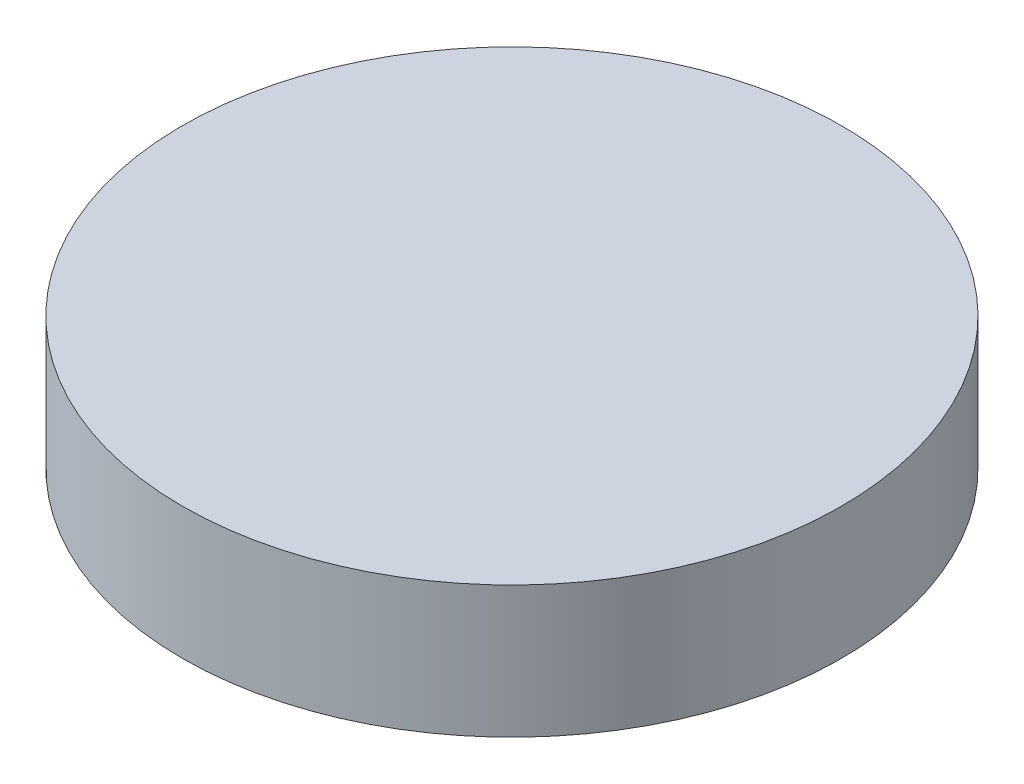
ISO-10303-21;
HEADER;
FILE_DESCRIPTION(('STEP AP214'),'2;1');
FILE_NAME('part.step','',(''),(''),'','','');
FILE_SCHEMA(('AUTOMOTIVE_DESIGN { 1 0 10303 214 1 1 1 1 }'));
ENDSEC;
DATA;
#1=APPLICATION_CONTEXT('core data for automotive mechanical design processes');
#2=APPLICATION_PROTOCOL_DEFINITION('international standard','automotive_design',2000,#1);
#3=PRODUCT_CONTEXT('',#1,'mechanical');
#4=PRODUCT('Part','Part','',(#3));
#5=PRODUCT_RELATED_PRODUCT_CATEGORY('part','',(#4));
#6=PRODUCT_DEFINITION_FORMATION('','',#4);
#7=PRODUCT_DEFINITION_CONTEXT('part definition',#1,'design');
#8=PRODUCT_DEFINITION('design','',#6,#7);
#9=PRODUCT_DEFINITION_SHAPE('','',#8);
#10=(LENGTH_UNIT() NAMED_UNIT(*) SI_UNIT(.MILLI.,.METRE.));
#11=(NAMED_UNIT(*) PLANE_ANGLE_UNIT() SI_UNIT($,.RADIAN.));
#12=(NAMED_UNIT(*) SI_UNIT($,.STERADIAN.) SOLID_ANGLE_UNIT());
#13=UNCERTAINTY_MEASURE_WITH_UNIT(LENGTH_MEASURE(1.E-05),#10,'distance_accuracy_value','');
#14=(GEOMETRIC_REPRESENTATION_CONTEXT(3) GLOBAL_UNCERTAINTY_ASSIGNED_CONTEXT((#13)) GLOBAL_UNIT_ASSIGNED_CONTEXT((#10,
#11,#12)) REPRESENTATION_CONTEXT('',''));
#15=CARTESIAN_POINT('',(0.,0.,0.));
#16=DIRECTION('',(0.,0.,1.));
#17=DIRECTION('',(1.,0.,0.));
#18=AXIS2_PLACEMENT_3D('',#15,#16,#17);
#19=CARTESIAN_POINT('',(0.,2.54,0.));
#20=DIRECTION('',(0.,-1.,0.));
#21=DIRECTION('',(0.,0.,-1.));
#22=AXIS2_PLACEMENT_3D('',#19,#20,#21);
#23=CYLINDRICAL_SURFACE('',#22,6.35);
#24=CARTESIAN_POINT('',(0.,2.54,0.));
#25=DIRECTION('',(0.,1.,0.));
#26=DIRECTION('',(0.,0.,1.));
#27=AXIS2_PLACEMENT_3D('',#24,#25,#26);
#28=CIRCLE('',#27,6.35);
#29=CARTESIAN_POINT('',(0.,2.54,6.35));
#30=VERTEX_POINT('',#29);
#31=EDGE_CURVE('E10',#30,#30,#28,.T.);
#32=ORIENTED_EDGE('',*,*,#31,.F.);
#33=EDGE_LOOP('',(#32));
#34=FACE_BOUND('',#33,.T.);
#35=CARTESIAN_POINT('',(0.,0.,0.));
#36=DIRECTION('',(0.,1.,0.));
#37=DIRECTION('',(0.,0.,1.));
#38=AXIS2_PLACEMENT_3D('',#35,#36,#37);
#39=CIRCLE('',#38,6.35);
#40=CARTESIAN_POINT('',(0.,0.,6.35));
#41=VERTEX_POINT('',#40);
#42=EDGE_CURVE('E33',#41,#41,#39,.T.);
#43=ORIENTED_EDGE('',*,*,#42,.T.);
#44=EDGE_LOOP('',(#43));
#45=FACE_BOUND('',#44,.T.);
#46=ADVANCED_FACE('F30',(#34,#45),#23,.T.);
#47=CARTESIAN_POINT('',(0.,2.54,0.));
#48=DIRECTION('',(0.,1.,0.));
#49=DIRECTION('',(0.,0.,1.));
#50=AXIS2_PLACEMENT_3D('',#47,#48,#49);
#51=PLANE('',#50);
#52=ORIENTED_EDGE('',*,*,#31,.T.);
#53=EDGE_LOOP('',(#52));
#54=FACE_BOUND('',#53,.T.);
#55=ADVANCED_FACE('F45',(#54),#51,.T.);
#56=CARTESIAN_POINT('',(0.,0.,0.));
#57=DIRECTION('',(0.,1.,0.));
#58=DIRECTION('',(0.,0.,1.));
#59=AXIS2_PLACEMENT_3D('',#56,#57,#58);
#60=PLANE('',#59);
#61=ORIENTED_EDGE('',*,*,#42,.F.);
#62=EDGE_LOOP('',(#61));
#63=FACE_BOUND('',#62,.T.);
#64=ADVANCED_FACE('F43',(#63),#60,.F.);
#65=CLOSED_SHELL('',(#46,#55,#64));
#66=MANIFOLD_SOLID_BREP('B2',#65);
#67=ADVANCED_BREP_SHAPE_REPRESENTATION('',(#18,#66),#14);
#68=SHAPE_DEFINITION_REPRESENTATION(#9,#67);
ENDSEC;
END-ISO-10303-21;
